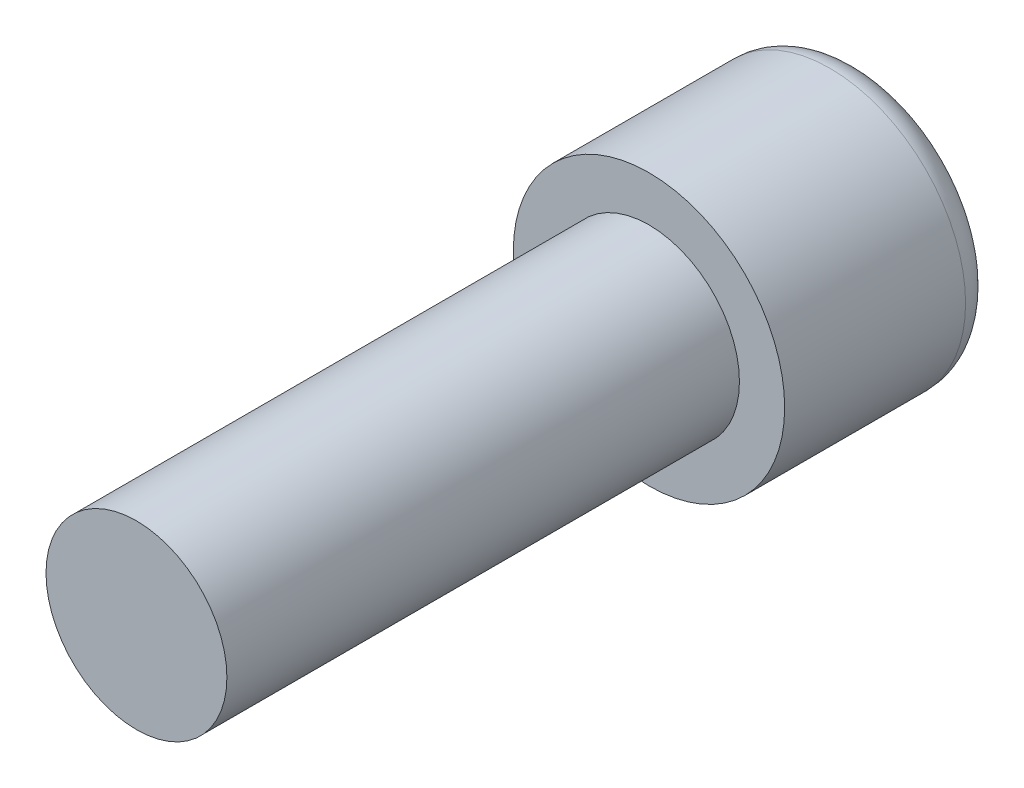
ISO-10303-21;
HEADER;
FILE_DESCRIPTION(('STEP AP214'),'2;1');
FILE_NAME('part.step','',(''),(''),'','','');
FILE_SCHEMA(('AUTOMOTIVE_DESIGN { 1 0 10303 214 1 1 1 1 }'));
ENDSEC;
DATA;
#1=APPLICATION_CONTEXT('core data for automotive mechanical design processes');
#2=APPLICATION_PROTOCOL_DEFINITION('international standard','automotive_design',2000,#1);
#3=PRODUCT_CONTEXT('',#1,'mechanical');
#4=PRODUCT('Part','Part','',(#3));
#5=PRODUCT_RELATED_PRODUCT_CATEGORY('part','',(#4));
#6=PRODUCT_DEFINITION_FORMATION('','',#4);
#7=PRODUCT_DEFINITION_CONTEXT('part definition',#1,'design');
#8=PRODUCT_DEFINITION('design','',#6,#7);
#9=PRODUCT_DEFINITION_SHAPE('','',#8);
#10=(LENGTH_UNIT() NAMED_UNIT(*) SI_UNIT(.MILLI.,.METRE.));
#11=(NAMED_UNIT(*) PLANE_ANGLE_UNIT() SI_UNIT($,.RADIAN.));
#12=(NAMED_UNIT(*) SI_UNIT($,.STERADIAN.) SOLID_ANGLE_UNIT());
#13=UNCERTAINTY_MEASURE_WITH_UNIT(LENGTH_MEASURE(1.E-05),#10,'distance_accuracy_value','');
#14=(GEOMETRIC_REPRESENTATION_CONTEXT(3) GLOBAL_UNCERTAINTY_ASSIGNED_CONTEXT((#13)) GLOBAL_UNIT_ASSIGNED_CONTEXT((#10,
#11,#12)) REPRESENTATION_CONTEXT('',''));
#15=CARTESIAN_POINT('',(0.,0.,0.));
#16=DIRECTION('',(0.,0.,1.));
#17=DIRECTION('',(1.,0.,0.));
#18=AXIS2_PLACEMENT_3D('',#15,#16,#17);
#19=CARTESIAN_POINT('',(0.,0.,4.25));
#20=DIRECTION('',(0.,0.,-1.));
#21=DIRECTION('',(-1.,0.,0.));
#22=AXIS2_PLACEMENT_3D('',#19,#20,#21);
#23=CYLINDRICAL_SURFACE('',#22,0.75);
#24=CARTESIAN_POINT('',(0.,0.,4.25));
#25=DIRECTION('',(0.,0.,1.));
#26=DIRECTION('',(1.,0.,0.));
#27=AXIS2_PLACEMENT_3D('',#24,#25,#26);
#28=CIRCLE('',#27,0.75);
#29=CARTESIAN_POINT('',(0.75,0.,4.25));
#30=VERTEX_POINT('',#29);
#31=EDGE_CURVE('E170',#30,#30,#28,.T.);
#32=ORIENTED_EDGE('',*,*,#31,.F.);
#33=EDGE_LOOP('',(#32));
#34=FACE_BOUND('',#33,.T.);
#35=CARTESIAN_POINT('',(0.,0.,0.));
#36=DIRECTION('',(0.,0.,1.));
#37=DIRECTION('',(1.,0.,0.));
#38=AXIS2_PLACEMENT_3D('',#35,#36,#37);
#39=CIRCLE('',#38,0.75);
#40=CARTESIAN_POINT('',(0.75,0.,0.));
#41=VERTEX_POINT('',#40);
#42=EDGE_CURVE('E169',#41,#41,#39,.T.);
#43=ORIENTED_EDGE('',*,*,#42,.T.);
#44=EDGE_LOOP('',(#43));
#45=FACE_BOUND('',#44,.T.);
#46=ADVANCED_FACE('F41',(#34,#45),#23,.T.);
#47=CARTESIAN_POINT('',(0.,0.,4.25));
#48=DIRECTION('',(0.,0.,1.));
#49=DIRECTION('',(1.,0.,0.));
#50=AXIS2_PLACEMENT_3D('',#47,#48,#49);
#51=PLANE('',#50);
#52=ORIENTED_EDGE('',*,*,#31,.T.);
#53=EDGE_LOOP('',(#52));
#54=FACE_BOUND('',#53,.T.);
#55=ADVANCED_FACE('F196',(#54),#51,.T.);
#56=CARTESIAN_POINT('',(0.,0.,-1.75));
#57=DIRECTION('',(0.,0.,1.));
#58=DIRECTION('',(1.,0.,0.));
#59=AXIS2_PLACEMENT_3D('',#56,#57,#58);
#60=CYLINDRICAL_SURFACE('',#59,1.125);
#61=CARTESIAN_POINT('',(0.,0.,-1.5));
#62=DIRECTION('',(0.,0.,-1.));
#63=DIRECTION('',(-1.,0.,0.));
#64=AXIS2_PLACEMENT_3D('',#61,#62,#63);
#65=CIRCLE('',#64,1.125);
#66=CARTESIAN_POINT('',(-1.125,0.,-1.5));
#67=VERTEX_POINT('',#66);
#68=EDGE_CURVE('E11',#67,#67,#65,.F.);
#69=ORIENTED_EDGE('',*,*,#68,.T.);
#70=EDGE_LOOP('',(#69));
#71=FACE_BOUND('',#70,.T.);
#72=CARTESIAN_POINT('',(0.,0.,0.));
#73=DIRECTION('',(0.,0.,-1.));
#74=DIRECTION('',(-1.,0.,0.));
#75=AXIS2_PLACEMENT_3D('',#72,#73,#74);
#76=CIRCLE('',#75,1.125);
#77=CARTESIAN_POINT('',(-1.125,0.,0.));
#78=VERTEX_POINT('',#77);
#79=EDGE_CURVE('E156',#78,#78,#76,.T.);
#80=ORIENTED_EDGE('',*,*,#79,.T.);
#81=EDGE_LOOP('',(#80));
#82=FACE_BOUND('',#81,.T.);
#83=ADVANCED_FACE('F201',(#71,#82),#60,.T.);
#84=CARTESIAN_POINT('',(0.,0.,-1.75));
#85=DIRECTION('',(0.,0.,-1.));
#86=DIRECTION('',(-1.,0.,0.));
#87=AXIS2_PLACEMENT_3D('',#84,#85,#86);
#88=PLANE('',#87);
#89=DIRECTION('',(-0.979994193041857,-0.199026082723448,0.));
#90=VECTOR('',#89,1.);
#91=CARTESIAN_POINT('',(0.478016246175271,-0.540679019128573,-1.75));
#92=LINE('',#91,#90);
#93=CARTESIAN_POINT('',(0.478016246175271,-0.540679019128573,-1.75));
#94=VERTEX_POINT('',#93);
#95=CARTESIAN_POINT('',(-0.229233642770961,-0.684313722173747,-1.75));
#96=VERTEX_POINT('',#95);
#97=EDGE_CURVE('E57',#94,#96,#92,.T.);
#98=ORIENTED_EDGE('',*,*,#97,.F.);
#99=DIRECTION('',(-0.317635452866719,-0.948212908097203,0.));
#100=VECTOR('',#99,1.);
#101=CARTESIAN_POINT('',(0.707249888946232,0.143634703045174,-1.75));
#102=LINE('',#101,#100);
#103=CARTESIAN_POINT('',(0.707249888946232,0.143634703045174,-1.75));
#104=VERTEX_POINT('',#103);
#105=EDGE_CURVE('E150',#104,#94,#102,.T.);
#106=ORIENTED_EDGE('',*,*,#105,.F.);
#107=DIRECTION('',(0.662358740175137,-0.749186825373755,0.));
#108=VECTOR('',#107,1.);
#109=CARTESIAN_POINT('',(0.229233642770961,0.684313722173747,-1.75));
#110=LINE('',#109,#108);
#111=CARTESIAN_POINT('',(0.229233642770961,0.684313722173747,-1.75));
#112=VERTEX_POINT('',#111);
#113=EDGE_CURVE('E147',#112,#104,#110,.T.);
#114=ORIENTED_EDGE('',*,*,#113,.F.);
#115=DIRECTION('',(0.979994193041856,0.199026082723448,0.));
#116=VECTOR('',#115,1.);
#117=CARTESIAN_POINT('',(-0.478016246175271,0.540679019128573,-1.75));
#118=LINE('',#117,#116);
#119=CARTESIAN_POINT('',(-0.478016246175271,0.540679019128573,-1.75));
#120=VERTEX_POINT('',#119);
#121=EDGE_CURVE('E105',#120,#112,#118,.T.);
#122=ORIENTED_EDGE('',*,*,#121,.F.);
#123=DIRECTION('',(0.317635452866719,0.948212908097203,0.));
#124=VECTOR('',#123,1.);
#125=CARTESIAN_POINT('',(-0.707249888946232,-0.143634703045174,-1.75));
#126=LINE('',#125,#124);
#127=CARTESIAN_POINT('',(-0.707249888946232,-0.143634703045174,-1.75));
#128=VERTEX_POINT('',#127);
#129=EDGE_CURVE('E141',#128,#120,#126,.T.);
#130=ORIENTED_EDGE('',*,*,#129,.F.);
#131=DIRECTION('',(-0.662358740175137,0.749186825373755,0.));
#132=VECTOR('',#131,1.);
#133=CARTESIAN_POINT('',(-0.229233642770961,-0.684313722173747,-1.75));
#134=LINE('',#133,#132);
#135=EDGE_CURVE('E137',#96,#128,#134,.T.);
#136=ORIENTED_EDGE('',*,*,#135,.F.);
#137=EDGE_LOOP('',(#98,#106,#114,#122,#130,#136));
#138=FACE_BOUND('',#137,.T.);
#139=CARTESIAN_POINT('',(0.,0.,-1.75));
#140=DIRECTION('',(0.,0.,-1.));
#141=DIRECTION('',(-1.,0.,0.));
#142=AXIS2_PLACEMENT_3D('',#139,#140,#141);
#143=CIRCLE('',#142,0.875);
#144=CARTESIAN_POINT('',(-0.875,0.,-1.75));
#145=VERTEX_POINT('',#144);
#146=EDGE_CURVE('E50',#145,#145,#143,.T.);
#147=ORIENTED_EDGE('',*,*,#146,.T.);
#148=EDGE_LOOP('',(#147));
#149=FACE_BOUND('',#148,.T.);
#150=ADVANCED_FACE('F180',(#138,#149),#88,.T.);
#151=CARTESIAN_POINT('',(0.,0.,0.));
#152=DIRECTION('',(0.,0.,-1.));
#153=DIRECTION('',(-1.,0.,0.));
#154=AXIS2_PLACEMENT_3D('',#151,#152,#153);
#155=PLANE('',#154);
#156=ORIENTED_EDGE('',*,*,#42,.F.);
#157=EDGE_LOOP('',(#156));
#158=FACE_BOUND('',#157,.T.);
#159=ORIENTED_EDGE('',*,*,#79,.F.);
#160=EDGE_LOOP('',(#159));
#161=FACE_BOUND('',#160,.T.);
#162=ADVANCED_FACE('F184',(#158,#161),#155,.F.);
#163=CARTESIAN_POINT('',(0.,0.,-1.5));
#164=DIRECTION('',(0.,0.,-1.));
#165=DIRECTION('',(-1.,0.,0.));
#166=AXIS2_PLACEMENT_3D('',#163,#164,#165);
#167=TOROIDAL_SURFACE('',#166,0.875,0.25);
#168=ORIENTED_EDGE('',*,*,#68,.F.);
#169=EDGE_LOOP('',(#168));
#170=FACE_BOUND('',#169,.T.);
#171=ORIENTED_EDGE('',*,*,#146,.F.);
#172=EDGE_LOOP('',(#171));
#173=FACE_BOUND('',#172,.T.);
#174=ADVANCED_FACE('F43',(#170,#173),#167,.T.);
#175=CARTESIAN_POINT('',(0.478016246175271,-0.540679019128573,-0.75));
#176=DIRECTION('',(0.199026082723448,-0.979994193041856,0.));
#177=DIRECTION('',(0.979994193041856,0.199026082723448,0.));
#178=AXIS2_PLACEMENT_3D('',#175,#176,#177);
#179=PLANE('',#178);
#180=ORIENTED_EDGE('',*,*,#97,.T.);
#181=DIRECTION('',(0.,0.,-1.));
#182=VECTOR('',#181,1.);
#183=CARTESIAN_POINT('',(-0.229233642770961,-0.684313722173747,-0.75));
#184=LINE('',#183,#182);
#185=CARTESIAN_POINT('',(-0.229233642770961,-0.684313722173747,-0.75));
#186=VERTEX_POINT('',#185);
#187=EDGE_CURVE('E87',#186,#96,#184,.T.);
#188=ORIENTED_EDGE('',*,*,#187,.F.);
#189=DIRECTION('',(-0.979994193041857,-0.199026082723448,0.));
#190=VECTOR('',#189,1.);
#191=CARTESIAN_POINT('',(0.478016246175271,-0.540679019128573,-0.75));
#192=LINE('',#191,#190);
#193=CARTESIAN_POINT('',(0.478016246175271,-0.540679019128573,-0.75));
#194=VERTEX_POINT('',#193);
#195=EDGE_CURVE('E153',#194,#186,#192,.T.);
#196=ORIENTED_EDGE('',*,*,#195,.F.);
#197=DIRECTION('',(0.,0.,-1.));
#198=VECTOR('',#197,1.);
#199=CARTESIAN_POINT('',(0.478016246175271,-0.540679019128573,-0.75));
#200=LINE('',#199,#198);
#201=EDGE_CURVE('E65',#194,#94,#200,.T.);
#202=ORIENTED_EDGE('',*,*,#201,.T.);
#203=EDGE_LOOP('',(#180,#188,#196,#202));
#204=FACE_BOUND('',#203,.T.);
#205=ADVANCED_FACE('F183',(#204),#179,.F.);
#206=CARTESIAN_POINT('',(0.707249888946232,0.143634703045174,-0.75));
#207=DIRECTION('',(0.948212908097203,-0.317635452866719,0.));
#208=DIRECTION('',(0.317635452866719,0.948212908097203,0.));
#209=AXIS2_PLACEMENT_3D('',#206,#207,#208);
#210=PLANE('',#209);
#211=ORIENTED_EDGE('',*,*,#105,.T.);
#212=ORIENTED_EDGE('',*,*,#201,.F.);
#213=DIRECTION('',(-0.317635452866719,-0.948212908097203,0.));
#214=VECTOR('',#213,1.);
#215=CARTESIAN_POINT('',(0.707249888946232,0.143634703045174,-0.75));
#216=LINE('',#215,#214);
#217=CARTESIAN_POINT('',(0.707249888946232,0.143634703045174,-0.75));
#218=VERTEX_POINT('',#217);
#219=EDGE_CURVE('E119',#218,#194,#216,.T.);
#220=ORIENTED_EDGE('',*,*,#219,.F.);
#221=DIRECTION('',(0.,0.,-1.));
#222=VECTOR('',#221,1.);
#223=CARTESIAN_POINT('',(0.707249888946232,0.143634703045174,-0.75));
#224=LINE('',#223,#222);
#225=EDGE_CURVE('E110',#218,#104,#224,.T.);
#226=ORIENTED_EDGE('',*,*,#225,.T.);
#227=EDGE_LOOP('',(#211,#212,#220,#226));
#228=FACE_BOUND('',#227,.T.);
#229=ADVANCED_FACE('F190',(#228),#210,.F.);
#230=CARTESIAN_POINT('',(0.229233642770961,0.684313722173747,-0.75));
#231=DIRECTION('',(0.749186825373755,0.662358740175137,0.));
#232=DIRECTION('',(-0.662358740175137,0.749186825373755,0.));
#233=AXIS2_PLACEMENT_3D('',#230,#231,#232);
#234=PLANE('',#233);
#235=ORIENTED_EDGE('',*,*,#113,.T.);
#236=ORIENTED_EDGE('',*,*,#225,.F.);
#237=DIRECTION('',(0.662358740175137,-0.749186825373755,0.));
#238=VECTOR('',#237,1.);
#239=CARTESIAN_POINT('',(0.229233642770961,0.684313722173747,-0.75));
#240=LINE('',#239,#238);
#241=CARTESIAN_POINT('',(0.229233642770961,0.684313722173747,-0.75));
#242=VERTEX_POINT('',#241);
#243=EDGE_CURVE('E114',#242,#218,#240,.T.);
#244=ORIENTED_EDGE('',*,*,#243,.F.);
#245=DIRECTION('',(0.,0.,-1.));
#246=VECTOR('',#245,1.);
#247=CARTESIAN_POINT('',(0.229233642770961,0.684313722173747,-0.75));
#248=LINE('',#247,#246);
#249=EDGE_CURVE('E98',#242,#112,#248,.T.);
#250=ORIENTED_EDGE('',*,*,#249,.T.);
#251=EDGE_LOOP('',(#235,#236,#244,#250));
#252=FACE_BOUND('',#251,.T.);
#253=ADVANCED_FACE('F115',(#252),#234,.F.);
#254=CARTESIAN_POINT('',(-0.478016246175271,0.540679019128573,-0.75));
#255=DIRECTION('',(-0.199026082723448,0.979994193041856,0.));
#256=DIRECTION('',(-0.979994193041856,-0.199026082723448,0.));
#257=AXIS2_PLACEMENT_3D('',#254,#255,#256);
#258=PLANE('',#257);
#259=ORIENTED_EDGE('',*,*,#121,.T.);
#260=ORIENTED_EDGE('',*,*,#249,.F.);
#261=DIRECTION('',(0.979994193041856,0.199026082723448,0.));
#262=VECTOR('',#261,1.);
#263=CARTESIAN_POINT('',(-0.478016246175271,0.540679019128573,-0.75));
#264=LINE('',#263,#262);
#265=CARTESIAN_POINT('',(-0.478016246175271,0.540679019128573,-0.75));
#266=VERTEX_POINT('',#265);
#267=EDGE_CURVE('E102',#266,#242,#264,.T.);
#268=ORIENTED_EDGE('',*,*,#267,.F.);
#269=DIRECTION('',(0.,0.,-1.));
#270=VECTOR('',#269,1.);
#271=CARTESIAN_POINT('',(-0.478016246175271,0.540679019128573,-0.75));
#272=LINE('',#271,#270);
#273=EDGE_CURVE('E111',#266,#120,#272,.T.);
#274=ORIENTED_EDGE('',*,*,#273,.T.);
#275=EDGE_LOOP('',(#259,#260,#268,#274));
#276=FACE_BOUND('',#275,.T.);
#277=ADVANCED_FACE('F100',(#276),#258,.F.);
#278=CARTESIAN_POINT('',(-0.707249888946232,-0.143634703045174,-0.75));
#279=DIRECTION('',(-0.948212908097203,0.317635452866719,0.));
#280=DIRECTION('',(-0.317635452866719,-0.948212908097203,0.));
#281=AXIS2_PLACEMENT_3D('',#278,#279,#280);
#282=PLANE('',#281);
#283=ORIENTED_EDGE('',*,*,#129,.T.);
#284=ORIENTED_EDGE('',*,*,#273,.F.);
#285=DIRECTION('',(0.317635452866719,0.948212908097203,0.));
#286=VECTOR('',#285,1.);
#287=CARTESIAN_POINT('',(-0.707249888946232,-0.143634703045174,-0.75));
#288=LINE('',#287,#286);
#289=CARTESIAN_POINT('',(-0.707249888946232,-0.143634703045174,-0.75));
#290=VERTEX_POINT('',#289);
#291=EDGE_CURVE('E125',#290,#266,#288,.T.);
#292=ORIENTED_EDGE('',*,*,#291,.F.);
#293=DIRECTION('',(0.,0.,-1.));
#294=VECTOR('',#293,1.);
#295=CARTESIAN_POINT('',(-0.707249888946232,-0.143634703045174,-0.75));
#296=LINE('',#295,#294);
#297=EDGE_CURVE('E161',#290,#128,#296,.T.);
#298=ORIENTED_EDGE('',*,*,#297,.T.);
#299=EDGE_LOOP('',(#283,#284,#292,#298));
#300=FACE_BOUND('',#299,.T.);
#301=ADVANCED_FACE('F216',(#300),#282,.F.);
#302=CARTESIAN_POINT('',(-0.229233642770961,-0.684313722173747,-0.75));
#303=DIRECTION('',(-0.749186825373755,-0.662358740175137,0.));
#304=DIRECTION('',(0.662358740175137,-0.749186825373755,0.));
#305=AXIS2_PLACEMENT_3D('',#302,#303,#304);
#306=PLANE('',#305);
#307=ORIENTED_EDGE('',*,*,#135,.T.);
#308=ORIENTED_EDGE('',*,*,#297,.F.);
#309=DIRECTION('',(-0.662358740175137,0.749186825373755,0.));
#310=VECTOR('',#309,1.);
#311=CARTESIAN_POINT('',(-0.229233642770961,-0.684313722173747,-0.75));
#312=LINE('',#311,#310);
#313=EDGE_CURVE('E129',#186,#290,#312,.T.);
#314=ORIENTED_EDGE('',*,*,#313,.F.);
#315=ORIENTED_EDGE('',*,*,#187,.T.);
#316=EDGE_LOOP('',(#307,#308,#314,#315));
#317=FACE_BOUND('',#316,.T.);
#318=ADVANCED_FACE('F213',(#317),#306,.F.);
#319=CARTESIAN_POINT('',(0.,0.,-0.75));
#320=DIRECTION('',(0.,0.,-1.));
#321=DIRECTION('',(-1.,0.,0.));
#322=AXIS2_PLACEMENT_3D('',#319,#320,#321);
#323=PLANE('',#322);
#324=ORIENTED_EDGE('',*,*,#195,.T.);
#325=ORIENTED_EDGE('',*,*,#313,.T.);
#326=ORIENTED_EDGE('',*,*,#291,.T.);
#327=ORIENTED_EDGE('',*,*,#267,.T.);
#328=ORIENTED_EDGE('',*,*,#243,.T.);
#329=ORIENTED_EDGE('',*,*,#219,.T.);
#330=EDGE_LOOP('',(#324,#325,#326,#327,#328,#329));
#331=FACE_BOUND('',#330,.T.);
#332=ADVANCED_FACE('F122',(#331),#323,.T.);
#333=CLOSED_SHELL('',(#46,#55,#83,#150,#162,#174,#205,#229,#253,#277,#301,#318,#332));
#334=MANIFOLD_SOLID_BREP('B2',#333);
#335=ADVANCED_BREP_SHAPE_REPRESENTATION('',(#18,#334),#14);
#336=SHAPE_DEFINITION_REPRESENTATION(#9,#335);
ENDSEC;
END-ISO-10303-21;
